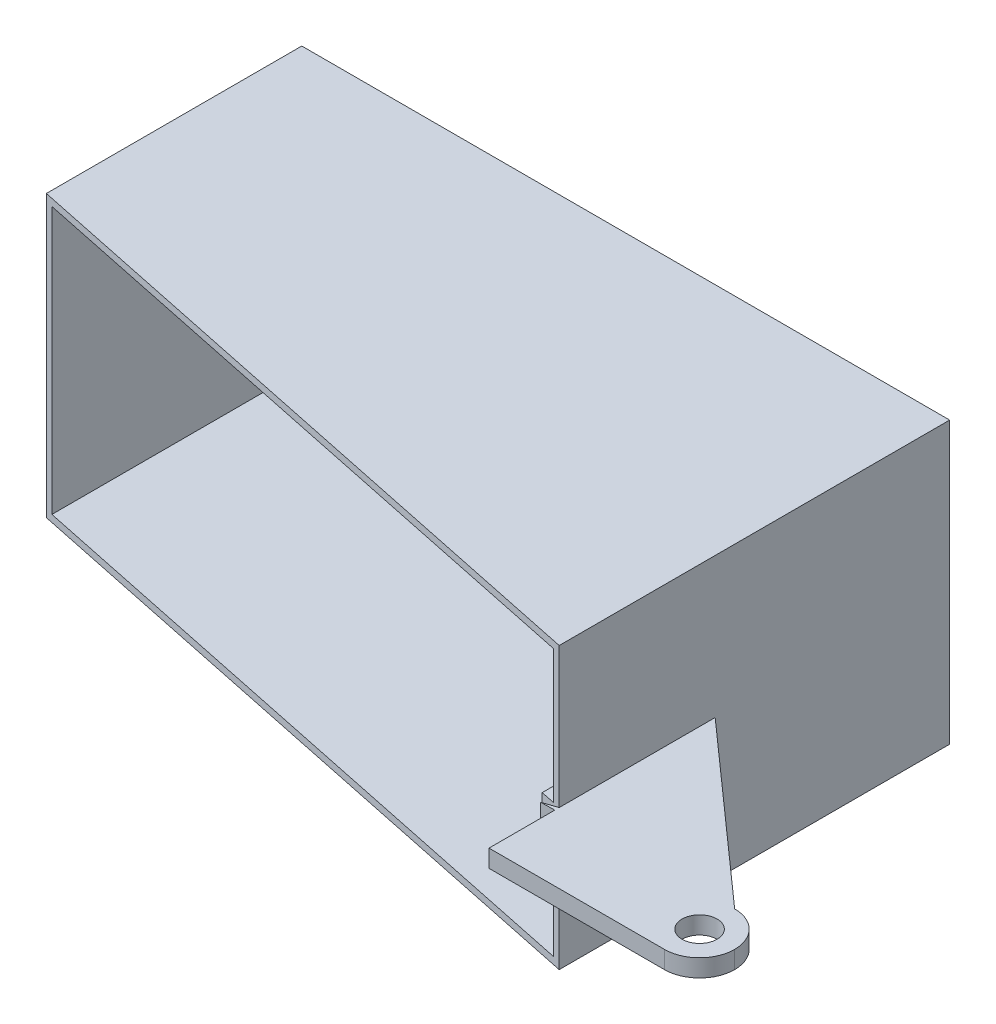
ISO-10303-21;
HEADER;
FILE_DESCRIPTION(('STEP AP214'),'2;1');
FILE_NAME('part.step','',(''),(''),'','','');
FILE_SCHEMA(('AUTOMOTIVE_DESIGN { 1 0 10303 214 1 1 1 1 }'));
ENDSEC;
DATA;
#1=APPLICATION_CONTEXT('core data for automotive mechanical design processes');
#2=APPLICATION_PROTOCOL_DEFINITION('international standard','automotive_design',2000,#1);
#3=PRODUCT_CONTEXT('',#1,'mechanical');
#4=PRODUCT('Part','Part','',(#3));
#5=PRODUCT_RELATED_PRODUCT_CATEGORY('part','',(#4));
#6=PRODUCT_DEFINITION_FORMATION('','',#4);
#7=PRODUCT_DEFINITION_CONTEXT('part definition',#1,'design');
#8=PRODUCT_DEFINITION('design','',#6,#7);
#9=PRODUCT_DEFINITION_SHAPE('','',#8);
#10=(LENGTH_UNIT() NAMED_UNIT(*) SI_UNIT(.MILLI.,.METRE.));
#11=(NAMED_UNIT(*) PLANE_ANGLE_UNIT() SI_UNIT($,.RADIAN.));
#12=(NAMED_UNIT(*) SI_UNIT($,.STERADIAN.) SOLID_ANGLE_UNIT());
#13=UNCERTAINTY_MEASURE_WITH_UNIT(LENGTH_MEASURE(1.E-05),#10,'distance_accuracy_value','');
#14=(GEOMETRIC_REPRESENTATION_CONTEXT(3) GLOBAL_UNCERTAINTY_ASSIGNED_CONTEXT((#13)) GLOBAL_UNIT_ASSIGNED_CONTEXT((#10,
#11,#12)) REPRESENTATION_CONTEXT('',''));
#15=CARTESIAN_POINT('',(0.,0.,0.));
#16=DIRECTION('',(0.,0.,1.));
#17=DIRECTION('',(1.,0.,0.));
#18=AXIS2_PLACEMENT_3D('',#15,#16,#17);
#19=CARTESIAN_POINT('',(114.695793510325,50.8,83.3548416912488));
#20=DIRECTION('',(-1.,0.,0.));
#21=DIRECTION('',(0.,0.,1.));
#22=AXIS2_PLACEMENT_3D('',#19,#20,#21);
#23=PLANE('',#22);
#24=DIRECTION('',(0.,-1.,0.));
#25=VECTOR('',#24,1.);
#26=CARTESIAN_POINT('',(114.695793510325,50.8,57.4254736912781));
#27=LINE('',#26,#25);
#28=CARTESIAN_POINT('',(114.695793510325,48.26,57.4254736912781));
#29=VERTEX_POINT('',#28);
#30=CARTESIAN_POINT('',(114.695793510325,-0.000101600000000073,57.4254736912781));
#31=VERTEX_POINT('',#30);
#32=EDGE_CURVE('E44',#29,#31,#27,.T.);
#33=ORIENTED_EDGE('',*,*,#32,.F.);
#34=DIRECTION('',(0.,0.,-1.));
#35=VECTOR('',#34,1.);
#36=CARTESIAN_POINT('',(114.695793510325,48.26,-83.3548416912488));
#37=LINE('',#36,#35);
#38=CARTESIAN_POINT('',(114.695793510325,48.26,-80.8148416912488));
#39=VERTEX_POINT('',#38);
#40=EDGE_CURVE('E222',#29,#39,#37,.T.);
#41=ORIENTED_EDGE('',*,*,#40,.T.);
#42=DIRECTION('',(0.,-1.,0.));
#43=VECTOR('',#42,1.);
#44=CARTESIAN_POINT('',(114.695793510325,50.8,-80.8148416912488));
#45=LINE('',#44,#43);
#46=CARTESIAN_POINT('',(114.695793510325,-48.26,-80.8148416912488));
#47=VERTEX_POINT('',#46);
#48=EDGE_CURVE('E217',#39,#47,#45,.T.);
#49=ORIENTED_EDGE('',*,*,#48,.T.);
#50=DIRECTION('',(0.,0.,-1.));
#51=VECTOR('',#50,1.);
#52=CARTESIAN_POINT('',(114.695793510325,-48.26,-83.3548416912488));
#53=LINE('',#52,#51);
#54=CARTESIAN_POINT('',(114.695793510325,-48.26,57.4254736912781));
#55=VERTEX_POINT('',#54);
#56=EDGE_CURVE('E214',#55,#47,#53,.T.);
#57=ORIENTED_EDGE('',*,*,#56,.F.);
#58=CARTESIAN_POINT('',(114.695793510325,-6.3501016,57.4254736912781));
#59=VERTEX_POINT('',#58);
#60=EDGE_CURVE('E279',#59,#55,#27,.T.);
#61=ORIENTED_EDGE('',*,*,#60,.F.);
#62=DIRECTION('',(0.,0.,1.));
#63=VECTOR('',#62,1.);
#64=CARTESIAN_POINT('',(114.695793510325,-6.3501016,83.3548416912488));
#65=LINE('',#64,#63);
#66=CARTESIAN_POINT('',(114.695793510325,-6.3501016,-0.746190396076768));
#67=VERTEX_POINT('',#66);
#68=EDGE_CURVE('E247',#67,#59,#65,.T.);
#69=ORIENTED_EDGE('',*,*,#68,.F.);
#70=DIRECTION('',(0.,-1.,0.));
#71=VECTOR('',#70,1.);
#72=CARTESIAN_POINT('',(114.695793510325,50.8,-0.746190396076776));
#73=LINE('',#72,#71);
#74=CARTESIAN_POINT('',(114.695793510325,-0.00010160000000813,-0.746190396076787));
#75=VERTEX_POINT('',#74);
#76=EDGE_CURVE('E224',#75,#67,#73,.T.);
#77=ORIENTED_EDGE('',*,*,#76,.F.);
#78=DIRECTION('',(0.,0.,1.));
#79=VECTOR('',#78,1.);
#80=CARTESIAN_POINT('',(114.695793510325,-0.000101599999996482,83.3548416912488));
#81=LINE('',#80,#79);
#82=EDGE_CURVE('E239',#75,#31,#81,.T.);
#83=ORIENTED_EDGE('',*,*,#82,.T.);
#84=EDGE_LOOP('',(#33,#41,#49,#57,#61,#69,#77,#83));
#85=FACE_BOUND('',#84,.T.);
#86=ADVANCED_FACE('F30',(#85),#23,.T.);
#87=CARTESIAN_POINT('',(-117.235793510325,50.8,-80.8148416912488));
#88=DIRECTION('',(0.,0.,1.));
#89=DIRECTION('',(1.,0.,0.));
#90=AXIS2_PLACEMENT_3D('',#87,#88,#89);
#91=PLANE('',#90);
#92=DIRECTION('',(-1.,0.,0.));
#93=VECTOR('',#92,1.);
#94=CARTESIAN_POINT('',(117.235793510325,-48.26,-80.8148416912488));
#95=LINE('',#94,#93);
#96=CARTESIAN_POINT('',(-114.695793510325,-48.26,-80.8148416912488));
#97=VERTEX_POINT('',#96);
#98=EDGE_CURVE('E220',#47,#97,#95,.T.);
#99=ORIENTED_EDGE('',*,*,#98,.F.);
#100=ORIENTED_EDGE('',*,*,#48,.F.);
#101=DIRECTION('',(-1.,0.,0.));
#102=VECTOR('',#101,1.);
#103=CARTESIAN_POINT('',(117.235793510325,48.26,-80.8148416912488));
#104=LINE('',#103,#102);
#105=CARTESIAN_POINT('',(-114.695793510325,48.26,-80.8148416912488));
#106=VERTEX_POINT('',#105);
#107=EDGE_CURVE('E215',#39,#106,#104,.T.);
#108=ORIENTED_EDGE('',*,*,#107,.T.);
#109=DIRECTION('',(0.,-1.,0.));
#110=VECTOR('',#109,1.);
#111=CARTESIAN_POINT('',(-114.695793510325,50.8,-80.8148416912488));
#112=LINE('',#111,#110);
#113=EDGE_CURVE('E211',#106,#97,#112,.T.);
#114=ORIENTED_EDGE('',*,*,#113,.T.);
#115=EDGE_LOOP('',(#99,#100,#108,#114));
#116=FACE_BOUND('',#115,.T.);
#117=ADVANCED_FACE('F361',(#116),#91,.T.);
#118=CARTESIAN_POINT('',(-114.695793510325,50.8,83.3548416912488));
#119=DIRECTION('',(1.,0.,0.));
#120=DIRECTION('',(0.,0.,-1.));
#121=AXIS2_PLACEMENT_3D('',#118,#119,#120);
#122=PLANE('',#121);
#123=DIRECTION('',(0.,1.,0.));
#124=VECTOR('',#123,1.);
#125=CARTESIAN_POINT('',(-114.695793510325,50.8,9.61737698607094));
#126=LINE('',#125,#124);
#127=CARTESIAN_POINT('',(-114.695793510325,-48.26,9.61737698607094));
#128=VERTEX_POINT('',#127);
#129=CARTESIAN_POINT('',(-114.695793510325,48.26,9.61737698607093));
#130=VERTEX_POINT('',#129);
#131=EDGE_CURVE('E283',#128,#130,#126,.T.);
#132=ORIENTED_EDGE('',*,*,#131,.F.);
#133=DIRECTION('',(0.,0.,1.));
#134=VECTOR('',#133,1.);
#135=CARTESIAN_POINT('',(-114.695793510325,-48.26,-83.3548416912488));
#136=LINE('',#135,#134);
#137=EDGE_CURVE('E210',#97,#128,#136,.T.);
#138=ORIENTED_EDGE('',*,*,#137,.F.);
#139=ORIENTED_EDGE('',*,*,#113,.F.);
#140=DIRECTION('',(0.,0.,1.));
#141=VECTOR('',#140,1.);
#142=CARTESIAN_POINT('',(-114.695793510325,48.26,-83.3548416912488));
#143=LINE('',#142,#141);
#144=EDGE_CURVE('E207',#106,#130,#143,.T.);
#145=ORIENTED_EDGE('',*,*,#144,.T.);
#146=EDGE_LOOP('',(#132,#138,#139,#145));
#147=FACE_BOUND('',#146,.T.);
#148=ADVANCED_FACE('F353',(#147),#122,.T.);
#149=CARTESIAN_POINT('',(117.235793510325,48.26,-83.3548416912488));
#150=DIRECTION('',(0.,-1.,0.));
#151=DIRECTION('',(0.,0.,-1.));
#152=AXIS2_PLACEMENT_3D('',#149,#150,#151);
#153=PLANE('',#152);
#154=DIRECTION('',(0.978964923189008,0.,0.204028623397652));
#155=VECTOR('',#154,1.);
#156=CARTESIAN_POINT('',(89.0110402679353,48.26,52.072447528418));
#157=LINE('',#156,#155);
#158=EDGE_CURVE('E281',#130,#29,#157,.T.);
#159=ORIENTED_EDGE('',*,*,#158,.F.);
#160=ORIENTED_EDGE('',*,*,#144,.F.);
#161=ORIENTED_EDGE('',*,*,#107,.F.);
#162=ORIENTED_EDGE('',*,*,#40,.F.);
#163=EDGE_LOOP('',(#159,#160,#161,#162));
#164=FACE_BOUND('',#163,.T.);
#165=ADVANCED_FACE('F357',(#164),#153,.T.);
#166=CARTESIAN_POINT('',(117.235793510325,-48.26,-83.3548416912488));
#167=DIRECTION('',(0.,-1.,0.));
#168=DIRECTION('',(0.,0.,-1.));
#169=AXIS2_PLACEMENT_3D('',#166,#167,#168);
#170=PLANE('',#169);
#171=ORIENTED_EDGE('',*,*,#137,.T.);
#172=DIRECTION('',(0.978964923189008,0.,0.204028623397652));
#173=VECTOR('',#172,1.);
#174=CARTESIAN_POINT('',(89.0110402679353,-48.26,52.072447528418));
#175=LINE('',#174,#173);
#176=EDGE_CURVE('E285',#128,#55,#175,.T.);
#177=ORIENTED_EDGE('',*,*,#176,.T.);
#178=ORIENTED_EDGE('',*,*,#56,.T.);
#179=ORIENTED_EDGE('',*,*,#98,.T.);
#180=EDGE_LOOP('',(#171,#177,#178,#179));
#181=FACE_BOUND('',#180,.T.);
#182=ADVANCED_FACE('F348',(#181),#170,.F.);
#183=CARTESIAN_POINT('',(109.467402242345,-6.35010160000001,-5.39355507788741));
#184=DIRECTION('',(-1.,0.,0.));
#185=DIRECTION('',(0.,0.,1.));
#186=AXIS2_PLACEMENT_3D('',#183,#184,#185);
#187=PLANE('',#186);
#188=DIRECTION('',(0.,-1.,0.));
#189=VECTOR('',#188,1.);
#190=CARTESIAN_POINT('',(109.467402242345,-6.35010160000001,56.3358110815951));
#191=LINE('',#190,#189);
#192=CARTESIAN_POINT('',(109.467402242345,-0.000101600000000224,56.3358110815951));
#193=VERTEX_POINT('',#192);
#194=CARTESIAN_POINT('',(109.467402242345,-6.35010160000001,56.3358110815951));
#195=VERTEX_POINT('',#194);
#196=EDGE_CURVE('E274',#193,#195,#191,.T.);
#197=ORIENTED_EDGE('',*,*,#196,.F.);
#198=DIRECTION('',(0.,0.,1.));
#199=VECTOR('',#198,1.);
#200=CARTESIAN_POINT('',(109.467402242345,-0.000101600000008773,-5.39355507788741));
#201=LINE('',#200,#199);
#202=CARTESIAN_POINT('',(109.467402242345,-0.000101600000008773,-5.39355507788741));
#203=VERTEX_POINT('',#202);
#204=EDGE_CURVE('E242',#203,#193,#201,.T.);
#205=ORIENTED_EDGE('',*,*,#204,.F.);
#206=DIRECTION('',(0.,1.,0.));
#207=VECTOR('',#206,1.);
#208=CARTESIAN_POINT('',(109.467402242345,-6.35010160000001,-5.39355507788741));
#209=LINE('',#208,#207);
#210=CARTESIAN_POINT('',(109.467402242345,-6.35010160000001,-5.39355507788741));
#211=VERTEX_POINT('',#210);
#212=EDGE_CURVE('E248',#211,#203,#209,.T.);
#213=ORIENTED_EDGE('',*,*,#212,.F.);
#214=DIRECTION('',(0.,0.,1.));
#215=VECTOR('',#214,1.);
#216=CARTESIAN_POINT('',(109.467402242345,-6.35010160000001,-5.39355507788741));
#217=LINE('',#216,#215);
#218=EDGE_CURVE('E324',#211,#195,#217,.T.);
#219=ORIENTED_EDGE('',*,*,#218,.T.);
#220=EDGE_LOOP('',(#197,#205,#213,#219));
#221=FACE_BOUND('',#220,.T.);
#222=ADVANCED_FACE('F340',(#221),#187,.T.);
#223=CARTESIAN_POINT('',(180.735793510325,-6.3501016,57.9548416912488));
#224=DIRECTION('',(0.664356314454094,0.,-0.747416006949926));
#225=DIRECTION('',(-0.747416006949926,0.,-0.664356314454094));
#226=AXIS2_PLACEMENT_3D('',#223,#224,#225);
#227=PLANE('',#226);
#228=DIRECTION('',(-0.747416006949927,0.,-0.664356314454094));
#229=VECTOR('',#228,1.);
#230=CARTESIAN_POINT('',(180.735793510325,-0.0001016,57.9548416912488));
#231=LINE('',#230,#229);
#232=EDGE_CURVE('E328',#75,#203,#231,.T.);
#233=ORIENTED_EDGE('',*,*,#232,.F.);
#234=ORIENTED_EDGE('',*,*,#76,.T.);
#235=DIRECTION('',(-0.747416006949927,0.,-0.664356314454094));
#236=VECTOR('',#235,1.);
#237=CARTESIAN_POINT('',(180.735793510325,-6.3501016,57.9548416912488));
#238=LINE('',#237,#236);
#239=EDGE_CURVE('E320',#67,#211,#238,.T.);
#240=ORIENTED_EDGE('',*,*,#239,.T.);
#241=ORIENTED_EDGE('',*,*,#212,.T.);
#242=EDGE_LOOP('',(#233,#234,#240,#241));
#243=FACE_BOUND('',#242,.T.);
#244=ADVANCED_FACE('F336',(#243),#227,.T.);
#245=CARTESIAN_POINT('',(109.467402242345,-6.3501016,59.7244597317541));
#246=DIRECTION('',(0.,-1.,0.));
#247=DIRECTION('',(0.,0.,-1.));
#248=AXIS2_PLACEMENT_3D('',#245,#246,#247);
#249=PLANE('',#248);
#250=DIRECTION('',(0.978964923189008,0.,0.204028623397652));
#251=VECTOR('',#250,1.);
#252=CARTESIAN_POINT('',(110.144240302458,-6.3501016,56.4768726604087));
#253=LINE('',#252,#251);
#254=EDGE_CURVE('E278',#195,#59,#253,.T.);
#255=ORIENTED_EDGE('',*,*,#254,.F.);
#256=ORIENTED_EDGE('',*,*,#218,.F.);
#257=ORIENTED_EDGE('',*,*,#239,.F.);
#258=ORIENTED_EDGE('',*,*,#68,.T.);
#259=EDGE_LOOP('',(#255,#256,#257,#258));
#260=FACE_BOUND('',#259,.T.);
#261=ADVANCED_FACE('F344',(#260),#249,.T.);
#262=CARTESIAN_POINT('',(109.467402242345,-0.000101599999999755,59.7244597317541));
#263=DIRECTION('',(0.,-1.,0.));
#264=DIRECTION('',(0.,0.,-1.));
#265=AXIS2_PLACEMENT_3D('',#262,#263,#264);
#266=PLANE('',#265);
#267=ORIENTED_EDGE('',*,*,#204,.T.);
#268=DIRECTION('',(0.978964923189008,0.,0.204028623397652));
#269=VECTOR('',#268,1.);
#270=CARTESIAN_POINT('',(110.144240302458,-0.000101600000000205,56.4768726604087));
#271=LINE('',#270,#269);
#272=EDGE_CURVE('E37',#193,#31,#271,.T.);
#273=ORIENTED_EDGE('',*,*,#272,.T.);
#274=ORIENTED_EDGE('',*,*,#82,.F.);
#275=ORIENTED_EDGE('',*,*,#232,.T.);
#276=EDGE_LOOP('',(#267,#273,#274,#275));
#277=FACE_BOUND('',#276,.T.);
#278=ADVANCED_FACE('F238',(#277),#266,.F.);
#279=CARTESIAN_POINT('',(117.235793510325,-50.8,57.9548416912488));
#280=DIRECTION('',(0.204028623397652,0.,-0.978964923189007));
#281=DIRECTION('',(-0.978964923189008,0.,-0.204028623397652));
#282=AXIS2_PLACEMENT_3D('',#279,#280,#281);
#283=PLANE('',#282);
#284=DIRECTION('',(-0.978964923189007,0.,-0.204028623397652));
#285=VECTOR('',#284,1.);
#286=CARTESIAN_POINT('',(117.235793510325,50.8,57.9548416912488));
#287=LINE('',#286,#285);
#288=CARTESIAN_POINT('',(117.235793510325,50.8,57.9548416912488));
#289=VERTEX_POINT('',#288);
#290=CARTESIAN_POINT('',(-117.235793510325,50.8,9.08800898610025));
#291=VERTEX_POINT('',#290);
#292=EDGE_CURVE('E178',#289,#291,#287,.T.);
#293=ORIENTED_EDGE('',*,*,#292,.T.);
#294=DIRECTION('',(0.,1.,0.));
#295=VECTOR('',#294,1.);
#296=CARTESIAN_POINT('',(-117.235793510325,-50.8,9.08800898610025));
#297=LINE('',#296,#295);
#298=CARTESIAN_POINT('',(-117.235793510325,-50.8,9.08800898610025));
#299=VERTEX_POINT('',#298);
#300=EDGE_CURVE('E172',#299,#291,#297,.T.);
#301=ORIENTED_EDGE('',*,*,#300,.F.);
#302=DIRECTION('',(-0.978964923189007,0.,-0.204028623397652));
#303=VECTOR('',#302,1.);
#304=CARTESIAN_POINT('',(117.235793510325,-50.8,57.9548416912488));
#305=LINE('',#304,#303);
#306=CARTESIAN_POINT('',(117.235793510325,-50.8,57.9548416912488));
#307=VERTEX_POINT('',#306);
#308=EDGE_CURVE('E165',#307,#299,#305,.T.);
#309=ORIENTED_EDGE('',*,*,#308,.F.);
#310=DIRECTION('',(0.,1.,0.));
#311=VECTOR('',#310,1.);
#312=CARTESIAN_POINT('',(117.235793510325,-50.800025,57.9548416912488));
#313=LINE('',#312,#311);
#314=CARTESIAN_POINT('',(117.235793510325,-6.3501016,57.9548416912488));
#315=VERTEX_POINT('',#314);
#316=EDGE_CURVE('E169',#307,#315,#313,.T.);
#317=ORIENTED_EDGE('',*,*,#316,.T.);
#318=DIRECTION('',(0.,1.,0.));
#319=VECTOR('',#318,1.);
#320=CARTESIAN_POINT('',(117.235793510325,-50.8,57.9548416912488));
#321=LINE('',#320,#319);
#322=CARTESIAN_POINT('',(117.235793510325,-0.000101600000003421,57.9548416912488));
#323=VERTEX_POINT('',#322);
#324=EDGE_CURVE('E177',#315,#323,#321,.T.);
#325=ORIENTED_EDGE('',*,*,#324,.T.);
#326=EDGE_CURVE('E189',#323,#289,#313,.T.);
#327=ORIENTED_EDGE('',*,*,#326,.T.);
#328=EDGE_LOOP('',(#293,#301,#309,#317,#325,#327));
#329=FACE_BOUND('',#328,.T.);
#330=ORIENTED_EDGE('',*,*,#131,.T.);
#331=ORIENTED_EDGE('',*,*,#158,.T.);
#332=ORIENTED_EDGE('',*,*,#32,.T.);
#333=ORIENTED_EDGE('',*,*,#272,.F.);
#334=ORIENTED_EDGE('',*,*,#196,.T.);
#335=ORIENTED_EDGE('',*,*,#254,.T.);
#336=ORIENTED_EDGE('',*,*,#60,.T.);
#337=ORIENTED_EDGE('',*,*,#176,.F.);
#338=EDGE_LOOP('',(#330,#331,#332,#333,#334,#335,#336,#337));
#339=FACE_BOUND('',#338,.T.);
#340=ADVANCED_FACE('F167',(#329,#339),#283,.F.);
#341=CARTESIAN_POINT('',(-117.235793510325,-50.8,136.319784791509));
#342=DIRECTION('',(0.316983964714724,0.,0.948430896857401));
#343=DIRECTION('',(0.948430896857402,0.,-0.316983964714724));
#344=AXIS2_PLACEMENT_3D('',#341,#342,#343);
#345=PLANE('',#344);
#346=DIRECTION('',(-0.948430896857402,0.,0.316983964714724));
#347=VECTOR('',#346,1.);
#348=CARTESIAN_POINT('',(109.715947796307,-6.3501016,60.4681196921769));
#349=LINE('',#348,#347);
#350=CARTESIAN_POINT('',(112.13953550088,-6.3501016,59.6581097673897));
#351=VERTEX_POINT('',#350);
#352=EDGE_CURVE('E289',#315,#351,#349,.T.);
#353=ORIENTED_EDGE('',*,*,#352,.T.);
#354=DIRECTION('',(0.,1.,0.));
#355=VECTOR('',#354,1.);
#356=CARTESIAN_POINT('',(112.13953550088,-6.3501016,59.6581097673897));
#357=LINE('',#356,#355);
#358=CARTESIAN_POINT('',(112.13953550088,-0.000101599999999764,59.6581097673897));
#359=VERTEX_POINT('',#358);
#360=EDGE_CURVE('E52',#351,#359,#357,.T.);
#361=ORIENTED_EDGE('',*,*,#360,.T.);
#362=DIRECTION('',(-0.948430896857402,0.,0.316983964714724));
#363=VECTOR('',#362,1.);
#364=CARTESIAN_POINT('',(109.715947796307,-0.000101599999999652,60.4681196921769));
#365=LINE('',#364,#363);
#366=EDGE_CURVE('E11',#323,#359,#365,.T.);
#367=ORIENTED_EDGE('',*,*,#366,.F.);
#368=ORIENTED_EDGE('',*,*,#324,.F.);
#369=EDGE_LOOP('',(#353,#361,#367,#368));
#370=FACE_BOUND('',#369,.T.);
#371=ADVANCED_FACE('F384',(#370),#345,.F.);
#372=CARTESIAN_POINT('',(-117.235793510325,50.8,-83.3548416912488));
#373=DIRECTION('',(0.,0.,1.));
#374=DIRECTION('',(1.,0.,0.));
#375=AXIS2_PLACEMENT_3D('',#372,#373,#374);
#376=PLANE('',#375);
#377=DIRECTION('',(-1.,0.,0.));
#378=VECTOR('',#377,1.);
#379=CARTESIAN_POINT('',(-117.235793510325,-50.8,-83.3548416912488));
#380=LINE('',#379,#378);
#381=CARTESIAN_POINT('',(117.235793510325,-50.8,-83.3548416912488));
#382=VERTEX_POINT('',#381);
#383=CARTESIAN_POINT('',(-117.235793510325,-50.8,-83.3548416912488));
#384=VERTEX_POINT('',#383);
#385=EDGE_CURVE('E188',#382,#384,#380,.T.);
#386=ORIENTED_EDGE('',*,*,#385,.T.);
#387=DIRECTION('',(0.,-1.,0.));
#388=VECTOR('',#387,1.);
#389=CARTESIAN_POINT('',(-117.235793510325,50.8,-83.3548416912488));
#390=LINE('',#389,#388);
#391=CARTESIAN_POINT('',(-117.235793510325,50.8,-83.3548416912488));
#392=VERTEX_POINT('',#391);
#393=EDGE_CURVE('E232',#392,#384,#390,.T.);
#394=ORIENTED_EDGE('',*,*,#393,.F.);
#395=DIRECTION('',(-1.,0.,0.));
#396=VECTOR('',#395,1.);
#397=CARTESIAN_POINT('',(-117.235793510325,50.8,-83.3548416912488));
#398=LINE('',#397,#396);
#399=CARTESIAN_POINT('',(117.235793510325,50.8,-83.3548416912488));
#400=VERTEX_POINT('',#399);
#401=EDGE_CURVE('E203',#400,#392,#398,.T.);
#402=ORIENTED_EDGE('',*,*,#401,.F.);
#403=DIRECTION('',(0.,-1.,0.));
#404=VECTOR('',#403,1.);
#405=CARTESIAN_POINT('',(117.235793510325,50.8,-83.3548416912488));
#406=LINE('',#405,#404);
#407=EDGE_CURVE('E194',#400,#382,#406,.T.);
#408=ORIENTED_EDGE('',*,*,#407,.T.);
#409=EDGE_LOOP('',(#386,#394,#402,#408));
#410=FACE_BOUND('',#409,.T.);
#411=ADVANCED_FACE('F265',(#410),#376,.F.);
#412=DIRECTION('',(0.,-1.,0.));
#413=VECTOR('',#412,1.);
#414=CARTESIAN_POINT('',(117.235793510325,50.8,1.51154160728188));
#415=LINE('',#414,#413);
#416=CARTESIAN_POINT('',(117.235793510325,-0.000101600000007817,1.51154160728189));
#417=VERTEX_POINT('',#416);
#418=CARTESIAN_POINT('',(117.235793510325,-6.3501016,1.51154160728189));
#419=VERTEX_POINT('',#418);
#420=EDGE_CURVE('E231',#417,#419,#415,.T.);
#421=ORIENTED_EDGE('',*,*,#420,.F.);
#422=CARTESIAN_POINT('',(180.735793510325,-0.0001016,57.9548416912488));
#423=VERTEX_POINT('',#422);
#424=EDGE_CURVE('E329',#423,#417,#231,.T.);
#425=ORIENTED_EDGE('',*,*,#424,.F.);
#426=DIRECTION('',(0.,1.,0.));
#427=VECTOR('',#426,1.);
#428=CARTESIAN_POINT('',(180.735793510325,-6.3501016,57.9548416912488));
#429=LINE('',#428,#427);
#430=CARTESIAN_POINT('',(180.735793510325,-6.3501016,57.9548416912488));
#431=VERTEX_POINT('',#430);
#432=EDGE_CURVE('E253',#431,#423,#429,.T.);
#433=ORIENTED_EDGE('',*,*,#432,.F.);
#434=EDGE_CURVE('E321',#431,#419,#238,.T.);
#435=ORIENTED_EDGE('',*,*,#434,.T.);
#436=EDGE_LOOP('',(#421,#425,#433,#435));
#437=FACE_BOUND('',#436,.T.);
#438=ADVANCED_FACE('F383',(#437),#227,.T.);
#439=CARTESIAN_POINT('',(180.735793510325,-6.35010159999999,70.6548416912488));
#440=DIRECTION('',(0.,-1.,0.));
#441=DIRECTION('',(0.,0.,-1.));
#442=AXIS2_PLACEMENT_3D('',#439,#440,#441);
#443=CYLINDRICAL_SURFACE('',#442,12.7);
#444=ORIENTED_EDGE('',*,*,#432,.T.);
#445=CARTESIAN_POINT('',(180.735793510325,-0.000101599999998217,70.6548416912488));
#446=DIRECTION('',(0.,-1.,0.));
#447=DIRECTION('',(0.,0.,-1.));
#448=AXIS2_PLACEMENT_3D('',#445,#446,#447);
#449=CIRCLE('',#448,12.7);
#450=CARTESIAN_POINT('',(193.435793510325,-0.000101599999998241,70.6548416912488));
#451=VERTEX_POINT('',#450);
#452=EDGE_CURVE('E623',#451,#423,#449,.F.);
#453=ORIENTED_EDGE('',*,*,#452,.F.);
#454=DIRECTION('',(0.,1.,0.));
#455=VECTOR('',#454,1.);
#456=CARTESIAN_POINT('',(193.435793510325,-0.00010160000001383,70.6548416912488));
#457=LINE('',#456,#455);
#458=CARTESIAN_POINT('',(193.435793510325,-6.3501016,70.6548416912488));
#459=VERTEX_POINT('',#458);
#460=EDGE_CURVE('E302',#459,#451,#457,.T.);
#461=ORIENTED_EDGE('',*,*,#460,.F.);
#462=CARTESIAN_POINT('',(180.735793510325,-6.3501016,70.6548416912488));
#463=DIRECTION('',(0.,1.,0.));
#464=DIRECTION('',(0.,0.,1.));
#465=AXIS2_PLACEMENT_3D('',#462,#463,#464);
#466=CIRCLE('',#465,12.7);
#467=EDGE_CURVE('E610',#431,#459,#466,.F.);
#468=ORIENTED_EDGE('',*,*,#467,.F.);
#469=EDGE_LOOP('',(#444,#453,#461,#468));
#470=FACE_BOUND('',#469,.T.);
#471=ADVANCED_FACE('F399',(#470),#443,.T.);
#472=CARTESIAN_POINT('',(180.735793510325,-6.3501016,70.6548416912488));
#473=DIRECTION('',(0.,1.,0.));
#474=DIRECTION('',(0.,0.,1.));
#475=AXIS2_PLACEMENT_3D('',#472,#473,#474);
#476=CYLINDRICAL_SURFACE('',#475,12.7);
#477=CARTESIAN_POINT('',(180.735793510325,-0.000101599999998217,70.6548416912488));
#478=DIRECTION('',(0.,-1.,0.));
#479=DIRECTION('',(0.,0.,-1.));
#480=AXIS2_PLACEMENT_3D('',#477,#478,#479);
#481=CIRCLE('',#480,12.7);
#482=CARTESIAN_POINT('',(180.735793510325,-0.000101599999996482,83.3548416912488));
#483=VERTEX_POINT('',#482);
#484=EDGE_CURVE('E317',#483,#451,#481,.F.);
#485=ORIENTED_EDGE('',*,*,#484,.F.);
#486=DIRECTION('',(0.,-1.,0.));
#487=VECTOR('',#486,1.);
#488=CARTESIAN_POINT('',(180.735793510325,-0.000101599999996482,83.3548416912488));
#489=LINE('',#488,#487);
#490=CARTESIAN_POINT('',(180.735793510325,-6.3501016,83.3548416912488));
#491=VERTEX_POINT('',#490);
#492=EDGE_CURVE('E607',#491,#483,#489,.F.);
#493=ORIENTED_EDGE('',*,*,#492,.F.);
#494=CARTESIAN_POINT('',(180.735793510325,-6.3501016,70.6548416912488));
#495=DIRECTION('',(0.,1.,0.));
#496=DIRECTION('',(0.,0.,1.));
#497=AXIS2_PLACEMENT_3D('',#494,#495,#496);
#498=CIRCLE('',#497,12.7);
#499=EDGE_CURVE('E615',#459,#491,#498,.F.);
#500=ORIENTED_EDGE('',*,*,#499,.F.);
#501=ORIENTED_EDGE('',*,*,#460,.T.);
#502=EDGE_LOOP('',(#485,#493,#500,#501));
#503=FACE_BOUND('',#502,.T.);
#504=ADVANCED_FACE('F402',(#503),#476,.T.);
#505=CARTESIAN_POINT('',(-117.235793510325,50.8,83.3548416912488));
#506=DIRECTION('',(0.,0.,-1.));
#507=DIRECTION('',(-1.,0.,0.));
#508=AXIS2_PLACEMENT_3D('',#505,#506,#507);
#509=PLANE('',#508);
#510=DIRECTION('',(-1.,0.,0.));
#511=VECTOR('',#510,1.);
#512=CARTESIAN_POINT('',(193.435793510325,-0.000101599999996482,83.3548416912488));
#513=LINE('',#512,#511);
#514=CARTESIAN_POINT('',(117.235793510325,-0.000101599999996482,83.3548416912488));
#515=VERTEX_POINT('',#514);
#516=EDGE_CURVE('E311',#483,#515,#513,.T.);
#517=ORIENTED_EDGE('',*,*,#516,.T.);
#518=DIRECTION('',(0.,1.,0.));
#519=VECTOR('',#518,1.);
#520=CARTESIAN_POINT('',(117.235793510325,-50.800025,83.3548416912488));
#521=LINE('',#520,#519);
#522=CARTESIAN_POINT('',(117.235793510325,-6.3501016,83.3548416912488));
#523=VERTEX_POINT('',#522);
#524=EDGE_CURVE('E291',#523,#515,#521,.T.);
#525=ORIENTED_EDGE('',*,*,#524,.F.);
#526=DIRECTION('',(-1.,0.,0.));
#527=VECTOR('',#526,1.);
#528=CARTESIAN_POINT('',(193.435793510325,-6.3501016,83.3548416912488));
#529=LINE('',#528,#527);
#530=EDGE_CURVE('E608',#491,#523,#529,.T.);
#531=ORIENTED_EDGE('',*,*,#530,.F.);
#532=ORIENTED_EDGE('',*,*,#492,.T.);
#533=EDGE_LOOP('',(#517,#525,#531,#532));
#534=FACE_BOUND('',#533,.T.);
#535=ADVANCED_FACE('F406',(#534),#509,.F.);
#536=CARTESIAN_POINT('',(117.235793510325,-50.800025,83.3548416912488));
#537=DIRECTION('',(1.,0.,0.));
#538=DIRECTION('',(0.,0.,-1.));
#539=AXIS2_PLACEMENT_3D('',#536,#537,#538);
#540=PLANE('',#539);
#541=DIRECTION('',(0.,1.,0.));
#542=VECTOR('',#541,1.);
#543=CARTESIAN_POINT('',(117.235793510325,-6.3501016,59.5315679730244));
#544=LINE('',#543,#542);
#545=CARTESIAN_POINT('',(117.235793510325,-6.3501016,59.5315679730244));
#546=VERTEX_POINT('',#545);
#547=CARTESIAN_POINT('',(117.235793510325,-0.000101599999999782,59.5315679730244));
#548=VERTEX_POINT('',#547);
#549=EDGE_CURVE('E313',#546,#548,#544,.T.);
#550=ORIENTED_EDGE('',*,*,#549,.F.);
#551=DIRECTION('',(0.,0.,-1.));
#552=VECTOR('',#551,1.);
#553=CARTESIAN_POINT('',(117.235793510325,-6.3501016,83.3548416912488));
#554=LINE('',#553,#552);
#555=EDGE_CURVE('E305',#523,#546,#554,.T.);
#556=ORIENTED_EDGE('',*,*,#555,.F.);
#557=ORIENTED_EDGE('',*,*,#524,.T.);
#558=DIRECTION('',(0.,0.,1.));
#559=VECTOR('',#558,1.);
#560=CARTESIAN_POINT('',(117.235793510325,-0.000101599999996482,83.3548416912488));
#561=LINE('',#560,#559);
#562=EDGE_CURVE('E308',#548,#515,#561,.T.);
#563=ORIENTED_EDGE('',*,*,#562,.F.);
#564=EDGE_LOOP('',(#550,#556,#557,#563));
#565=FACE_BOUND('',#564,.T.);
#566=ADVANCED_FACE('F410',(#565),#540,.F.);
#567=CARTESIAN_POINT('',(180.735793510325,-0.000101599999998217,70.6548416912488));
#568=DIRECTION('',(0.,1.,0.));
#569=DIRECTION('',(0.,0.,1.));
#570=AXIS2_PLACEMENT_3D('',#567,#568,#569);
#571=CYLINDRICAL_SURFACE('',#570,6.34999999999999);
#572=CARTESIAN_POINT('',(180.735793510325,-0.000101599999997439,70.6548416912488));
#573=DIRECTION('',(0.,1.,0.));
#574=DIRECTION('',(0.,0.,1.));
#575=AXIS2_PLACEMENT_3D('',#572,#573,#574);
#576=CIRCLE('',#575,6.34999999999999);
#577=CARTESIAN_POINT('',(180.735793510325,-0.00010159999999656,77.0048416912488));
#578=VERTEX_POINT('',#577);
#579=EDGE_CURVE('E296',#578,#578,#576,.T.);
#580=ORIENTED_EDGE('',*,*,#579,.T.);
#581=EDGE_LOOP('',(#580));
#582=FACE_BOUND('',#581,.T.);
#583=CARTESIAN_POINT('',(180.735793510325,-6.3501016,70.6548416912488));
#584=DIRECTION('',(0.,1.,0.));
#585=DIRECTION('',(0.,0.,1.));
#586=AXIS2_PLACEMENT_3D('',#583,#584,#585);
#587=CIRCLE('',#586,6.34999999999999);
#588=CARTESIAN_POINT('',(180.735793510325,-6.3501016,77.0048416912488));
#589=VERTEX_POINT('',#588);
#590=EDGE_CURVE('E299',#589,#589,#587,.T.);
#591=ORIENTED_EDGE('',*,*,#590,.F.);
#592=EDGE_LOOP('',(#591));
#593=FACE_BOUND('',#592,.T.);
#594=ADVANCED_FACE('F412',(#582,#593),#571,.F.);
#595=ORIENTED_EDGE('',*,*,#579,.F.);
#596=EDGE_LOOP('',(#595));
#597=FACE_BOUND('',#596,.T.);
#598=DIRECTION('',(0.,0.,1.));
#599=VECTOR('',#598,1.);
#600=CARTESIAN_POINT('',(117.235793510325,-0.000101599999996482,83.3548416912488));
#601=LINE('',#600,#599);
#602=EDGE_CURVE('E228',#417,#323,#601,.T.);
#603=ORIENTED_EDGE('',*,*,#602,.T.);
#604=ORIENTED_EDGE('',*,*,#366,.T.);
#605=DIRECTION('',(0.999691869703219,0.,-0.0248226841675343));
#606=VECTOR('',#605,1.);
#607=CARTESIAN_POINT('',(109.467402242345,-0.000101599999999755,59.7244597317541));
#608=LINE('',#607,#606);
#609=EDGE_CURVE('E316',#359,#548,#608,.T.);
#610=ORIENTED_EDGE('',*,*,#609,.T.);
#611=ORIENTED_EDGE('',*,*,#562,.T.);
#612=ORIENTED_EDGE('',*,*,#516,.F.);
#613=ORIENTED_EDGE('',*,*,#484,.T.);
#614=ORIENTED_EDGE('',*,*,#452,.T.);
#615=ORIENTED_EDGE('',*,*,#424,.T.);
#616=EDGE_LOOP('',(#603,#604,#610,#611,#612,#613,#614,#615));
#617=FACE_BOUND('',#616,.T.);
#618=ADVANCED_FACE('F380',(#597,#617),#266,.F.);
#619=CARTESIAN_POINT('',(-117.235793510325,50.8,83.3548416912488));
#620=DIRECTION('',(1.,0.,0.));
#621=DIRECTION('',(0.,0.,-1.));
#622=AXIS2_PLACEMENT_3D('',#619,#620,#621);
#623=PLANE('',#622);
#624=DIRECTION('',(0.,0.,1.));
#625=VECTOR('',#624,1.);
#626=CARTESIAN_POINT('',(-117.235793510325,-50.8,83.3548416912488));
#627=LINE('',#626,#625);
#628=EDGE_CURVE('E205',#384,#299,#627,.T.);
#629=ORIENTED_EDGE('',*,*,#628,.T.);
#630=ORIENTED_EDGE('',*,*,#300,.T.);
#631=DIRECTION('',(0.,0.,1.));
#632=VECTOR('',#631,1.);
#633=CARTESIAN_POINT('',(-117.235793510325,50.8,83.3548416912488));
#634=LINE('',#633,#632);
#635=EDGE_CURVE('E193',#392,#291,#634,.T.);
#636=ORIENTED_EDGE('',*,*,#635,.F.);
#637=ORIENTED_EDGE('',*,*,#393,.T.);
#638=EDGE_LOOP('',(#629,#630,#636,#637));
#639=FACE_BOUND('',#638,.T.);
#640=ADVANCED_FACE('F260',(#639),#623,.F.);
#641=CARTESIAN_POINT('',(117.235793510325,50.8,-83.3548416912488));
#642=DIRECTION('',(0.,-1.,0.));
#643=DIRECTION('',(0.,0.,-1.));
#644=AXIS2_PLACEMENT_3D('',#641,#642,#643);
#645=PLANE('',#644);
#646=ORIENTED_EDGE('',*,*,#635,.T.);
#647=ORIENTED_EDGE('',*,*,#292,.F.);
#648=DIRECTION('',(0.,0.,-1.));
#649=VECTOR('',#648,1.);
#650=CARTESIAN_POINT('',(117.235793510325,50.8,83.3548416912488));
#651=LINE('',#650,#649);
#652=EDGE_CURVE('E197',#289,#400,#651,.T.);
#653=ORIENTED_EDGE('',*,*,#652,.T.);
#654=ORIENTED_EDGE('',*,*,#401,.T.);
#655=EDGE_LOOP('',(#646,#647,#653,#654));
#656=FACE_BOUND('',#655,.T.);
#657=ADVANCED_FACE('F270',(#656),#645,.F.);
#658=CARTESIAN_POINT('',(117.235793510325,-50.8,-83.3548416912488));
#659=DIRECTION('',(0.,-1.,0.));
#660=DIRECTION('',(0.,0.,-1.));
#661=AXIS2_PLACEMENT_3D('',#658,#659,#660);
#662=PLANE('',#661);
#663=ORIENTED_EDGE('',*,*,#308,.T.);
#664=ORIENTED_EDGE('',*,*,#628,.F.);
#665=ORIENTED_EDGE('',*,*,#385,.F.);
#666=DIRECTION('',(0.,0.,-1.));
#667=VECTOR('',#666,1.);
#668=CARTESIAN_POINT('',(117.235793510325,-50.8,83.3548416912488));
#669=LINE('',#668,#667);
#670=EDGE_CURVE('E184',#307,#382,#669,.T.);
#671=ORIENTED_EDGE('',*,*,#670,.F.);
#672=EDGE_LOOP('',(#663,#664,#665,#671));
#673=FACE_BOUND('',#672,.T.);
#674=ADVANCED_FACE('F191',(#673),#662,.T.);
#675=ORIENTED_EDGE('',*,*,#352,.F.);
#676=DIRECTION('',(0.,0.,1.));
#677=VECTOR('',#676,1.);
#678=CARTESIAN_POINT('',(117.235793510325,-6.3501016,83.3548416912488));
#679=LINE('',#678,#677);
#680=EDGE_CURVE('E187',#419,#315,#679,.T.);
#681=ORIENTED_EDGE('',*,*,#680,.F.);
#682=ORIENTED_EDGE('',*,*,#434,.F.);
#683=ORIENTED_EDGE('',*,*,#467,.T.);
#684=ORIENTED_EDGE('',*,*,#499,.T.);
#685=ORIENTED_EDGE('',*,*,#530,.T.);
#686=ORIENTED_EDGE('',*,*,#555,.T.);
#687=DIRECTION('',(0.999691869703219,0.,-0.0248226841675343));
#688=VECTOR('',#687,1.);
#689=CARTESIAN_POINT('',(109.467402242345,-6.3501016,59.7244597317541));
#690=LINE('',#689,#688);
#691=EDGE_CURVE('E318',#351,#546,#690,.T.);
#692=ORIENTED_EDGE('',*,*,#691,.F.);
#693=EDGE_LOOP('',(#675,#681,#682,#683,#684,#685,#686,#692));
#694=FACE_BOUND('',#693,.T.);
#695=ORIENTED_EDGE('',*,*,#590,.T.);
#696=EDGE_LOOP('',(#695));
#697=FACE_BOUND('',#696,.T.);
#698=ADVANCED_FACE('F377',(#694,#697),#249,.T.);
#699=CARTESIAN_POINT('',(117.235793510325,50.8,83.3548416912488));
#700=DIRECTION('',(-1.,0.,0.));
#701=DIRECTION('',(0.,0.,1.));
#702=AXIS2_PLACEMENT_3D('',#699,#700,#701);
#703=PLANE('',#702);
#704=ORIENTED_EDGE('',*,*,#420,.T.);
#705=ORIENTED_EDGE('',*,*,#680,.T.);
#706=ORIENTED_EDGE('',*,*,#316,.F.);
#707=ORIENTED_EDGE('',*,*,#670,.T.);
#708=ORIENTED_EDGE('',*,*,#407,.F.);
#709=ORIENTED_EDGE('',*,*,#652,.F.);
#710=ORIENTED_EDGE('',*,*,#326,.F.);
#711=ORIENTED_EDGE('',*,*,#602,.F.);
#712=EDGE_LOOP('',(#704,#705,#706,#707,#708,#709,#710,#711));
#713=FACE_BOUND('',#712,.T.);
#714=ADVANCED_FACE('F182',(#713),#703,.F.);
#715=CARTESIAN_POINT('',(109.467402242345,-6.3501016,59.7244597317541));
#716=DIRECTION('',(0.0248226841675343,0.,0.999691869703219));
#717=DIRECTION('',(0.99969186970322,0.,-0.0248226841675343));
#718=AXIS2_PLACEMENT_3D('',#715,#716,#717);
#719=PLANE('',#718);
#720=ORIENTED_EDGE('',*,*,#360,.F.);
#721=ORIENTED_EDGE('',*,*,#691,.T.);
#722=ORIENTED_EDGE('',*,*,#549,.T.);
#723=ORIENTED_EDGE('',*,*,#609,.F.);
#724=EDGE_LOOP('',(#720,#721,#722,#723));
#725=FACE_BOUND('',#724,.T.);
#726=ADVANCED_FACE('F387',(#725),#719,.T.);
#727=CLOSED_SHELL('',(#86,#117,#148,#165,#182,#222,#244,#261,#278,#340,#371,#411,#438,#471,#504,
#535,#566,#594,#618,#640,#657,#674,#698,#714,#726));
#728=MANIFOLD_SOLID_BREP('B2',#727);
#729=ADVANCED_BREP_SHAPE_REPRESENTATION('',(#18,#728),#14);
#730=SHAPE_DEFINITION_REPRESENTATION(#9,#729);
ENDSEC;
END-ISO-10303-21;
